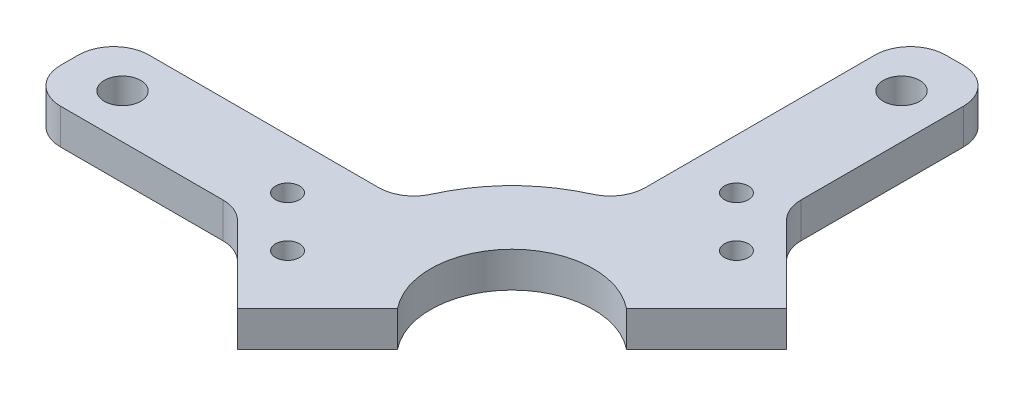
ISO-10303-21;
HEADER;
FILE_DESCRIPTION(('STEP AP214'),'2;1');
FILE_NAME('part.step','',(''),(''),'','','');
FILE_SCHEMA(('AUTOMOTIVE_DESIGN { 1 0 10303 214 1 1 1 1 }'));
ENDSEC;
DATA;
#1=APPLICATION_CONTEXT('core data for automotive mechanical design processes');
#2=APPLICATION_PROTOCOL_DEFINITION('international standard','automotive_design',2000,#1);
#3=PRODUCT_CONTEXT('',#1,'mechanical');
#4=PRODUCT('Part','Part','',(#3));
#5=PRODUCT_RELATED_PRODUCT_CATEGORY('part','',(#4));
#6=PRODUCT_DEFINITION_FORMATION('','',#4);
#7=PRODUCT_DEFINITION_CONTEXT('part definition',#1,'design');
#8=PRODUCT_DEFINITION('design','',#6,#7);
#9=PRODUCT_DEFINITION_SHAPE('','',#8);
#10=(LENGTH_UNIT() NAMED_UNIT(*) SI_UNIT(.MILLI.,.METRE.));
#11=(NAMED_UNIT(*) PLANE_ANGLE_UNIT() SI_UNIT($,.RADIAN.));
#12=(NAMED_UNIT(*) SI_UNIT($,.STERADIAN.) SOLID_ANGLE_UNIT());
#13=UNCERTAINTY_MEASURE_WITH_UNIT(LENGTH_MEASURE(1.E-05),#10,'distance_accuracy_value','');
#14=(GEOMETRIC_REPRESENTATION_CONTEXT(3) GLOBAL_UNCERTAINTY_ASSIGNED_CONTEXT((#13)) GLOBAL_UNIT_ASSIGNED_CONTEXT((#10,
#11,#12)) REPRESENTATION_CONTEXT('',''));
#15=CARTESIAN_POINT('',(0.,0.,0.));
#16=DIRECTION('',(0.,0.,1.));
#17=DIRECTION('',(1.,0.,0.));
#18=AXIS2_PLACEMENT_3D('',#15,#16,#17);
#19=CARTESIAN_POINT('',(7.93750000000073,0.,-73.0249999999999));
#20=DIRECTION('',(1.,0.,0.));
#21=DIRECTION('',(0.,0.,-1.));
#22=AXIS2_PLACEMENT_3D('',#19,#20,#21);
#23=PLANE('',#22);
#24=DIRECTION('',(0.,0.,-1.));
#25=VECTOR('',#24,1.);
#26=CARTESIAN_POINT('',(7.93750000000073,6.35,-73.0249999999999));
#27=LINE('',#26,#25);
#28=CARTESIAN_POINT('',(7.93750000000044,6.35,-43.9246129988201));
#29=VERTEX_POINT('',#28);
#30=CARTESIAN_POINT('',(7.93750000000073,6.35,-73.0249999999999));
#31=VERTEX_POINT('',#30);
#32=EDGE_CURVE('E235',#29,#31,#27,.T.);
#33=ORIENTED_EDGE('',*,*,#32,.F.);
#34=DIRECTION('',(0.,-1.,0.));
#35=VECTOR('',#34,1.);
#36=CARTESIAN_POINT('',(7.93750000000044,0.,-43.9246129988201));
#37=LINE('',#36,#35);
#38=CARTESIAN_POINT('',(7.93750000000044,0.,-43.9246129988201));
#39=VERTEX_POINT('',#38);
#40=EDGE_CURVE('E402',#29,#39,#37,.T.);
#41=ORIENTED_EDGE('',*,*,#40,.T.);
#42=DIRECTION('',(0.,0.,-1.));
#43=VECTOR('',#42,1.);
#44=CARTESIAN_POINT('',(7.93750000000073,0.,-73.0249999999999));
#45=LINE('',#44,#43);
#46=CARTESIAN_POINT('',(7.93750000000073,0.,-73.0249999999999));
#47=VERTEX_POINT('',#46);
#48=EDGE_CURVE('E303',#39,#47,#45,.T.);
#49=ORIENTED_EDGE('',*,*,#48,.T.);
#50=DIRECTION('',(0.,1.,0.));
#51=VECTOR('',#50,1.);
#52=CARTESIAN_POINT('',(7.93750000000073,0.,-73.0249999999999));
#53=LINE('',#52,#51);
#54=EDGE_CURVE('E298',#47,#31,#53,.T.);
#55=ORIENTED_EDGE('',*,*,#54,.T.);
#56=EDGE_LOOP('',(#33,#41,#49,#55));
#57=FACE_BOUND('',#56,.T.);
#58=ADVANCED_FACE('F39',(#57),#23,.T.);
#59=CARTESIAN_POINT('',(0.,6.35,0.));
#60=DIRECTION('',(0.,1.,0.));
#61=DIRECTION('',(0.,0.,1.));
#62=AXIS2_PLACEMENT_3D('',#59,#60,#61);
#63=PLANE('',#62);
#64=CARTESIAN_POINT('',(10.0230122421383,6.35,-30.2285885145439));
#65=DIRECTION('',(0.,1.,0.));
#66=DIRECTION('',(0.,0.,1.));
#67=AXIS2_PLACEMENT_3D('',#64,#65,#66);
#68=CIRCLE('',#67,2.15265);
#69=CARTESIAN_POINT('',(10.0230122421383,6.35,-28.0759385145439));
#70=VERTEX_POINT('',#69);
#71=EDGE_CURVE('E508',#70,#70,#68,.T.);
#72=ORIENTED_EDGE('',*,*,#71,.F.);
#73=EDGE_LOOP('',(#72));
#74=FACE_BOUND('',#73,.T.);
#75=CARTESIAN_POINT('',(1.04275612106917,6.35,-39.208844635613));
#76=DIRECTION('',(0.,1.,0.));
#77=DIRECTION('',(0.,0.,1.));
#78=AXIS2_PLACEMENT_3D('',#75,#76,#77);
#79=CIRCLE('',#78,2.15265);
#80=CARTESIAN_POINT('',(1.04275612106917,6.35,-37.056194635613));
#81=VERTEX_POINT('',#80);
#82=EDGE_CURVE('E496',#81,#81,#79,.T.);
#83=ORIENTED_EDGE('',*,*,#82,.F.);
#84=EDGE_LOOP('',(#83));
#85=FACE_BOUND('',#84,.T.);
#86=DIRECTION('',(0.,0.,1.));
#87=VECTOR('',#86,1.);
#88=CARTESIAN_POINT('',(-7.93749999999926,6.35,-73.0250000000001));
#89=LINE('',#88,#87);
#90=CARTESIAN_POINT('',(-7.93749999999926,6.35,-73.0250000000001));
#91=VERTEX_POINT('',#90);
#92=CARTESIAN_POINT('',(-7.93749999999969,6.35,-31.8688400910671));
#93=VERTEX_POINT('',#92);
#94=EDGE_CURVE('E316',#91,#93,#89,.T.);
#95=ORIENTED_EDGE('',*,*,#94,.T.);
#96=CARTESIAN_POINT('',(-14.2874999999997,6.35,-31.8688400910672));
#97=DIRECTION('',(0.,1.,0.));
#98=DIRECTION('',(0.,0.,1.));
#99=AXIS2_PLACEMENT_3D('',#96,#97,#98);
#100=CIRCLE('',#99,6.35);
#101=CARTESIAN_POINT('',(-11.6897727272725,6.35,-26.0745055290549));
#102=VERTEX_POINT('',#101);
#103=EDGE_CURVE('E393',#93,#102,#100,.F.);
#104=ORIENTED_EDGE('',*,*,#103,.T.);
#105=CARTESIAN_POINT('',(0.,6.35,0.));
#106=DIRECTION('',(0.,1.,0.));
#107=DIRECTION('',(0.,0.,1.));
#108=AXIS2_PLACEMENT_3D('',#105,#106,#107);
#109=CIRCLE('',#108,28.575);
#110=CARTESIAN_POINT('',(-26.0745055290548,6.35,-11.6897727272727));
#111=VERTEX_POINT('',#110);
#112=EDGE_CURVE('E282',#102,#111,#109,.T.);
#113=ORIENTED_EDGE('',*,*,#112,.T.);
#114=CARTESIAN_POINT('',(-31.868840091067,6.35,-14.2875));
#115=DIRECTION('',(0.,1.,0.));
#116=DIRECTION('',(0.,0.,1.));
#117=AXIS2_PLACEMENT_3D('',#114,#115,#116);
#118=CIRCLE('',#117,6.35);
#119=CARTESIAN_POINT('',(-31.868840091067,6.35,-7.93749999999998));
#120=VERTEX_POINT('',#119);
#121=EDGE_CURVE('E396',#111,#120,#118,.F.);
#122=ORIENTED_EDGE('',*,*,#121,.T.);
#123=DIRECTION('',(-1.,0.,0.));
#124=VECTOR('',#123,1.);
#125=CARTESIAN_POINT('',(-73.025,6.35,-7.93749999999997));
#126=LINE('',#125,#124);
#127=CARTESIAN_POINT('',(-73.025,6.35,-7.93749999999997));
#128=VERTEX_POINT('',#127);
#129=EDGE_CURVE('E279',#120,#128,#126,.T.);
#130=ORIENTED_EDGE('',*,*,#129,.T.);
#131=CARTESIAN_POINT('',(-73.025,6.35,-1.58749999999997));
#132=DIRECTION('',(0.,1.,0.));
#133=DIRECTION('',(0.,0.,1.));
#134=AXIS2_PLACEMENT_3D('',#131,#132,#133);
#135=CIRCLE('',#134,6.35);
#136=CARTESIAN_POINT('',(-79.375,6.35,-1.58749999999997));
#137=VERTEX_POINT('',#136);
#138=EDGE_CURVE('E275',#128,#137,#135,.T.);
#139=ORIENTED_EDGE('',*,*,#138,.T.);
#140=DIRECTION('',(0.,0.,1.));
#141=VECTOR('',#140,1.);
#142=CARTESIAN_POINT('',(-79.375,6.35,-1.58749999999997));
#143=LINE('',#142,#141);
#144=CARTESIAN_POINT('',(-79.375,6.35,1.58750000000003));
#145=VERTEX_POINT('',#144);
#146=EDGE_CURVE('E271',#137,#145,#143,.T.);
#147=ORIENTED_EDGE('',*,*,#146,.T.);
#148=CARTESIAN_POINT('',(-73.025,6.35,1.58750000000003));
#149=DIRECTION('',(0.,1.,0.));
#150=DIRECTION('',(0.,0.,-1.));
#151=AXIS2_PLACEMENT_3D('',#148,#149,#150);
#152=CIRCLE('',#151,6.35);
#153=CARTESIAN_POINT('',(-73.025,6.35,7.93750000000003));
#154=VERTEX_POINT('',#153);
#155=EDGE_CURVE('E267',#145,#154,#152,.T.);
#156=ORIENTED_EDGE('',*,*,#155,.T.);
#157=DIRECTION('',(1.,0.,0.));
#158=VECTOR('',#157,1.);
#159=CARTESIAN_POINT('',(-73.025,6.35,7.93750000000003));
#160=LINE('',#159,#158);
#161=CARTESIAN_POINT('',(-43.9246129988205,6.35,7.93750000000003));
#162=VERTEX_POINT('',#161);
#163=EDGE_CURVE('E263',#154,#162,#160,.T.);
#164=ORIENTED_EDGE('',*,*,#163,.T.);
#165=CARTESIAN_POINT('',(-43.9246129988205,6.35,14.2875));
#166=DIRECTION('',(0.,1.,0.));
#167=DIRECTION('',(0.,0.,1.));
#168=AXIS2_PLACEMENT_3D('',#165,#166,#167);
#169=CIRCLE('',#168,6.35);
#170=CARTESIAN_POINT('',(-39.4344849382859,6.35,9.79737193946545));
#171=VERTEX_POINT('',#170);
#172=EDGE_CURVE('E11',#162,#171,#169,.F.);
#173=ORIENTED_EDGE('',*,*,#172,.T.);
#174=DIRECTION('',(0.707106781186548,0.,0.707106781186547));
#175=VECTOR('',#174,1.);
#176=CARTESIAN_POINT('',(-25.7384604540093,6.35,23.4933964237421));
#177=LINE('',#176,#175);
#178=CARTESIAN_POINT('',(-25.7384604540093,6.35,23.4933964237421));
#179=VERTEX_POINT('',#178);
#180=EDGE_CURVE('E225',#171,#179,#177,.T.);
#181=ORIENTED_EDGE('',*,*,#180,.T.);
#182=DIRECTION('',(-0.707106781186546,0.,0.707106781186549));
#183=VECTOR('',#182,1.);
#184=CARTESIAN_POINT('',(-38.2941829917116,6.35,36.0491189614445));
#185=LINE('',#184,#183);
#186=CARTESIAN_POINT('',(-11.3886381111663,6.35,9.14357408089908));
#187=VERTEX_POINT('',#186);
#188=EDGE_CURVE('E243',#187,#179,#185,.T.);
#189=ORIENTED_EDGE('',*,*,#188,.F.);
#190=CARTESIAN_POINT('',(0.,6.35,0.));
#191=DIRECTION('',(0.,1.,0.));
#192=DIRECTION('',(0.,0.,1.));
#193=AXIS2_PLACEMENT_3D('',#190,#191,#192);
#194=CIRCLE('',#193,14.605);
#195=CARTESIAN_POINT('',(9.14357408089904,6.35,-11.3886381111664));
#196=VERTEX_POINT('',#195);
#197=EDGE_CURVE('E363',#196,#187,#194,.T.);
#198=ORIENTED_EDGE('',*,*,#197,.F.);
#199=CARTESIAN_POINT('',(23.4933964237421,6.35,-25.7384604540093));
#200=VERTEX_POINT('',#199);
#201=EDGE_CURVE('E239',#200,#196,#185,.T.);
#202=ORIENTED_EDGE('',*,*,#201,.F.);
#203=DIRECTION('',(0.707106781186547,0.,0.707106781186547));
#204=VECTOR('',#203,1.);
#205=CARTESIAN_POINT('',(23.4933964237421,6.35,-25.7384604540093));
#206=LINE('',#205,#204);
#207=CARTESIAN_POINT('',(9.79737193946587,6.35,-39.4344849382855));
#208=VERTEX_POINT('',#207);
#209=EDGE_CURVE('E189',#208,#200,#206,.T.);
#210=ORIENTED_EDGE('',*,*,#209,.F.);
#211=CARTESIAN_POINT('',(14.2875000000004,6.35,-43.9246129988201));
#212=DIRECTION('',(0.,1.,0.));
#213=DIRECTION('',(0.,0.,1.));
#214=AXIS2_PLACEMENT_3D('',#211,#212,#213);
#215=CIRCLE('',#214,6.35);
#216=EDGE_CURVE('E417',#208,#29,#215,.F.);
#217=ORIENTED_EDGE('',*,*,#216,.T.);
#218=ORIENTED_EDGE('',*,*,#32,.T.);
#219=CARTESIAN_POINT('',(1.58750000000073,6.35,-73.025));
#220=DIRECTION('',(0.,1.,0.));
#221=DIRECTION('',(-1.,0.,0.));
#222=AXIS2_PLACEMENT_3D('',#219,#220,#221);
#223=CIRCLE('',#222,6.35);
#224=CARTESIAN_POINT('',(1.5875000000008,6.35,-79.375));
#225=VERTEX_POINT('',#224);
#226=EDGE_CURVE('E327',#31,#225,#223,.T.);
#227=ORIENTED_EDGE('',*,*,#226,.T.);
#228=DIRECTION('',(-1.,0.,0.));
#229=VECTOR('',#228,1.);
#230=CARTESIAN_POINT('',(1.5875000000008,6.35,-79.375));
#231=LINE('',#230,#229);
#232=CARTESIAN_POINT('',(-1.5874999999992,6.35,-79.375));
#233=VERTEX_POINT('',#232);
#234=EDGE_CURVE('E323',#225,#233,#231,.T.);
#235=ORIENTED_EDGE('',*,*,#234,.T.);
#236=CARTESIAN_POINT('',(-1.58749999999927,6.35,-73.025));
#237=DIRECTION('',(0.,1.,0.));
#238=DIRECTION('',(1.,0.,0.));
#239=AXIS2_PLACEMENT_3D('',#236,#237,#238);
#240=CIRCLE('',#239,6.35);
#241=EDGE_CURVE('E319',#233,#91,#240,.T.);
#242=ORIENTED_EDGE('',*,*,#241,.T.);
#243=EDGE_LOOP('',(#95,#104,#113,#122,#130,#139,#147,#156,#164,#173,#181,#189,#198,#202,#210,
#217,#218,#227,#235,#242));
#244=FACE_BOUND('',#243,.T.);
#245=CARTESIAN_POINT('',(7.31639914554578E-13,6.35,-69.85));
#246=DIRECTION('',(0.,1.,0.));
#247=DIRECTION('',(0.,0.,1.));
#248=AXIS2_PLACEMENT_3D('',#245,#246,#247);
#249=CIRCLE('',#248,3.2639);
#250=CARTESIAN_POINT('',(7.31639914554578E-13,6.35,-66.5861));
#251=VERTEX_POINT('',#250);
#252=EDGE_CURVE('E244',#251,#251,#249,.T.);
#253=ORIENTED_EDGE('',*,*,#252,.F.);
#254=EDGE_LOOP('',(#253));
#255=FACE_BOUND('',#254,.T.);
#256=CARTESIAN_POINT('',(-30.2285885145439,6.35,10.0230122421383));
#257=DIRECTION('',(0.,1.,0.));
#258=DIRECTION('',(0.,0.,1.));
#259=AXIS2_PLACEMENT_3D('',#256,#257,#258);
#260=CIRCLE('',#259,2.15265);
#261=CARTESIAN_POINT('',(-30.2285885145439,6.35,12.1756622421383));
#262=VERTEX_POINT('',#261);
#263=EDGE_CURVE('E206',#262,#262,#260,.T.);
#264=ORIENTED_EDGE('',*,*,#263,.F.);
#265=EDGE_LOOP('',(#264));
#266=FACE_BOUND('',#265,.T.);
#267=CARTESIAN_POINT('',(-39.208844635613,6.35,1.04275612106918));
#268=DIRECTION('',(0.,1.,0.));
#269=DIRECTION('',(0.,0.,1.));
#270=AXIS2_PLACEMENT_3D('',#267,#268,#269);
#271=CIRCLE('',#270,2.15265);
#272=CARTESIAN_POINT('',(-39.208844635613,6.35,3.19540612106918));
#273=VERTEX_POINT('',#272);
#274=EDGE_CURVE('E217',#273,#273,#271,.T.);
#275=ORIENTED_EDGE('',*,*,#274,.F.);
#276=EDGE_LOOP('',(#275));
#277=FACE_BOUND('',#276,.T.);
#278=CARTESIAN_POINT('',(-69.85,6.35,0.));
#279=DIRECTION('',(0.,1.,0.));
#280=DIRECTION('',(0.,0.,1.));
#281=AXIS2_PLACEMENT_3D('',#278,#279,#280);
#282=CIRCLE('',#281,3.2639);
#283=CARTESIAN_POINT('',(-69.85,6.35,3.2639));
#284=VERTEX_POINT('',#283);
#285=EDGE_CURVE('E307',#284,#284,#282,.T.);
#286=ORIENTED_EDGE('',*,*,#285,.F.);
#287=EDGE_LOOP('',(#286));
#288=FACE_BOUND('',#287,.T.);
#289=ADVANCED_FACE('F427',(#74,#85,#244,#255,#266,#277,#288),#63,.T.);
#290=CARTESIAN_POINT('',(0.,0.,0.));
#291=DIRECTION('',(0.,1.,0.));
#292=DIRECTION('',(0.,0.,1.));
#293=AXIS2_PLACEMENT_3D('',#290,#291,#292);
#294=PLANE('',#293);
#295=CARTESIAN_POINT('',(10.0230122421383,0.,-30.2285885145439));
#296=DIRECTION('',(0.,1.,0.));
#297=DIRECTION('',(0.,0.,1.));
#298=AXIS2_PLACEMENT_3D('',#295,#296,#297);
#299=CIRCLE('',#298,2.15265);
#300=CARTESIAN_POINT('',(10.0230122421383,0.,-28.0759385145439));
#301=VERTEX_POINT('',#300);
#302=EDGE_CURVE('E502',#301,#301,#299,.T.);
#303=ORIENTED_EDGE('',*,*,#302,.T.);
#304=EDGE_LOOP('',(#303));
#305=FACE_BOUND('',#304,.T.);
#306=CARTESIAN_POINT('',(1.04275612106917,0.,-39.208844635613));
#307=DIRECTION('',(0.,1.,0.));
#308=DIRECTION('',(0.,0.,1.));
#309=AXIS2_PLACEMENT_3D('',#306,#307,#308);
#310=CIRCLE('',#309,2.15265);
#311=CARTESIAN_POINT('',(1.04275612106917,0.,-37.056194635613));
#312=VERTEX_POINT('',#311);
#313=EDGE_CURVE('E493',#312,#312,#310,.T.);
#314=ORIENTED_EDGE('',*,*,#313,.T.);
#315=EDGE_LOOP('',(#314));
#316=FACE_BOUND('',#315,.T.);
#317=DIRECTION('',(-0.707106781186546,0.,0.707106781186549));
#318=VECTOR('',#317,1.);
#319=CARTESIAN_POINT('',(-38.2941829917116,0.,36.0491189614445));
#320=LINE('',#319,#318);
#321=CARTESIAN_POINT('',(23.4933964237421,0.,-25.7384604540093));
#322=VERTEX_POINT('',#321);
#323=CARTESIAN_POINT('',(9.14357408089904,0.,-11.3886381111664));
#324=VERTEX_POINT('',#323);
#325=EDGE_CURVE('E180',#322,#324,#320,.T.);
#326=ORIENTED_EDGE('',*,*,#325,.T.);
#327=CARTESIAN_POINT('',(0.,0.,0.));
#328=DIRECTION('',(0.,1.,0.));
#329=DIRECTION('',(0.,0.,1.));
#330=AXIS2_PLACEMENT_3D('',#327,#328,#329);
#331=CIRCLE('',#330,14.605);
#332=CARTESIAN_POINT('',(-11.3886381111663,0.,9.14357408089908));
#333=VERTEX_POINT('',#332);
#334=EDGE_CURVE('E198',#324,#333,#331,.T.);
#335=ORIENTED_EDGE('',*,*,#334,.T.);
#336=CARTESIAN_POINT('',(-25.7384604540093,0.,23.4933964237421));
#337=VERTEX_POINT('',#336);
#338=EDGE_CURVE('E201',#333,#337,#320,.T.);
#339=ORIENTED_EDGE('',*,*,#338,.T.);
#340=DIRECTION('',(0.707106781186548,0.,0.707106781186547));
#341=VECTOR('',#340,1.);
#342=CARTESIAN_POINT('',(-25.7384604540093,0.,23.4933964237421));
#343=LINE('',#342,#341);
#344=CARTESIAN_POINT('',(-39.4344849382859,0.,9.79737193946545));
#345=VERTEX_POINT('',#344);
#346=EDGE_CURVE('E226',#345,#337,#343,.T.);
#347=ORIENTED_EDGE('',*,*,#346,.F.);
#348=CARTESIAN_POINT('',(-43.9246129988205,0.,14.2875));
#349=DIRECTION('',(0.,1.,0.));
#350=DIRECTION('',(0.,0.,1.));
#351=AXIS2_PLACEMENT_3D('',#348,#349,#350);
#352=CIRCLE('',#351,6.35);
#353=CARTESIAN_POINT('',(-43.9246129988205,0.,7.93750000000003));
#354=VERTEX_POINT('',#353);
#355=EDGE_CURVE('E48',#345,#354,#352,.T.);
#356=ORIENTED_EDGE('',*,*,#355,.T.);
#357=DIRECTION('',(1.,0.,0.));
#358=VECTOR('',#357,1.);
#359=CARTESIAN_POINT('',(-73.025,0.,7.93750000000003));
#360=LINE('',#359,#358);
#361=CARTESIAN_POINT('',(-73.025,0.,7.93750000000003));
#362=VERTEX_POINT('',#361);
#363=EDGE_CURVE('E283',#362,#354,#360,.T.);
#364=ORIENTED_EDGE('',*,*,#363,.F.);
#365=CARTESIAN_POINT('',(-73.025,0.,1.58750000000003));
#366=DIRECTION('',(0.,1.,0.));
#367=DIRECTION('',(0.,0.,-1.));
#368=AXIS2_PLACEMENT_3D('',#365,#366,#367);
#369=CIRCLE('',#368,6.35);
#370=CARTESIAN_POINT('',(-79.375,0.,1.58750000000003));
#371=VERTEX_POINT('',#370);
#372=EDGE_CURVE('E249',#371,#362,#369,.T.);
#373=ORIENTED_EDGE('',*,*,#372,.F.);
#374=DIRECTION('',(0.,0.,1.));
#375=VECTOR('',#374,1.);
#376=CARTESIAN_POINT('',(-79.375,0.,-1.58749999999997));
#377=LINE('',#376,#375);
#378=CARTESIAN_POINT('',(-79.375,0.,-1.58749999999997));
#379=VERTEX_POINT('',#378);
#380=EDGE_CURVE('E259',#379,#371,#377,.T.);
#381=ORIENTED_EDGE('',*,*,#380,.F.);
#382=CARTESIAN_POINT('',(-73.025,0.,-1.58749999999997));
#383=DIRECTION('',(0.,1.,0.));
#384=DIRECTION('',(0.,0.,1.));
#385=AXIS2_PLACEMENT_3D('',#382,#383,#384);
#386=CIRCLE('',#385,6.35);
#387=CARTESIAN_POINT('',(-73.025,0.,-7.93749999999997));
#388=VERTEX_POINT('',#387);
#389=EDGE_CURVE('E255',#388,#379,#386,.T.);
#390=ORIENTED_EDGE('',*,*,#389,.F.);
#391=DIRECTION('',(-1.,0.,0.));
#392=VECTOR('',#391,1.);
#393=CARTESIAN_POINT('',(-73.025,0.,-7.93749999999997));
#394=LINE('',#393,#392);
#395=CARTESIAN_POINT('',(-31.868840091067,0.,-7.93749999999998));
#396=VERTEX_POINT('',#395);
#397=EDGE_CURVE('E250',#396,#388,#394,.T.);
#398=ORIENTED_EDGE('',*,*,#397,.F.);
#399=CARTESIAN_POINT('',(-31.868840091067,0.,-14.2875));
#400=DIRECTION('',(0.,1.,0.));
#401=DIRECTION('',(0.,0.,1.));
#402=AXIS2_PLACEMENT_3D('',#399,#400,#401);
#403=CIRCLE('',#402,6.35);
#404=CARTESIAN_POINT('',(-26.0745055290548,0.,-11.6897727272727));
#405=VERTEX_POINT('',#404);
#406=EDGE_CURVE('E399',#396,#405,#403,.T.);
#407=ORIENTED_EDGE('',*,*,#406,.T.);
#408=CARTESIAN_POINT('',(0.,0.,0.));
#409=DIRECTION('',(0.,1.,0.));
#410=DIRECTION('',(0.,0.,1.));
#411=AXIS2_PLACEMENT_3D('',#408,#409,#410);
#412=CIRCLE('',#411,28.575);
#413=CARTESIAN_POINT('',(-11.6897727272725,0.,-26.0745055290549));
#414=VERTEX_POINT('',#413);
#415=EDGE_CURVE('E286',#414,#405,#412,.T.);
#416=ORIENTED_EDGE('',*,*,#415,.F.);
#417=CARTESIAN_POINT('',(-14.2874999999997,0.,-31.8688400910672));
#418=DIRECTION('',(0.,1.,0.));
#419=DIRECTION('',(0.,0.,1.));
#420=AXIS2_PLACEMENT_3D('',#417,#418,#419);
#421=CIRCLE('',#420,6.35);
#422=CARTESIAN_POINT('',(-7.93749999999969,0.,-31.8688400910671));
#423=VERTEX_POINT('',#422);
#424=EDGE_CURVE('E389',#414,#423,#421,.T.);
#425=ORIENTED_EDGE('',*,*,#424,.T.);
#426=DIRECTION('',(0.,0.,1.));
#427=VECTOR('',#426,1.);
#428=CARTESIAN_POINT('',(-7.93749999999926,0.,-73.0250000000001));
#429=LINE('',#428,#427);
#430=CARTESIAN_POINT('',(-7.93749999999926,0.,-73.0250000000001));
#431=VERTEX_POINT('',#430);
#432=EDGE_CURVE('E254',#431,#423,#429,.T.);
#433=ORIENTED_EDGE('',*,*,#432,.F.);
#434=CARTESIAN_POINT('',(-1.58749999999927,0.,-73.025));
#435=DIRECTION('',(0.,1.,0.));
#436=DIRECTION('',(1.,0.,0.));
#437=AXIS2_PLACEMENT_3D('',#434,#435,#436);
#438=CIRCLE('',#437,6.35);
#439=CARTESIAN_POINT('',(-1.5874999999992,0.,-79.375));
#440=VERTEX_POINT('',#439);
#441=EDGE_CURVE('E302',#440,#431,#438,.T.);
#442=ORIENTED_EDGE('',*,*,#441,.F.);
#443=DIRECTION('',(-1.,0.,0.));
#444=VECTOR('',#443,1.);
#445=CARTESIAN_POINT('',(1.5875000000008,0.,-79.375));
#446=LINE('',#445,#444);
#447=CARTESIAN_POINT('',(1.5875000000008,0.,-79.375));
#448=VERTEX_POINT('',#447);
#449=EDGE_CURVE('E312',#448,#440,#446,.T.);
#450=ORIENTED_EDGE('',*,*,#449,.F.);
#451=CARTESIAN_POINT('',(1.58750000000073,0.,-73.025));
#452=DIRECTION('',(0.,1.,0.));
#453=DIRECTION('',(-1.,0.,0.));
#454=AXIS2_PLACEMENT_3D('',#451,#452,#453);
#455=CIRCLE('',#454,6.35);
#456=EDGE_CURVE('E308',#47,#448,#455,.T.);
#457=ORIENTED_EDGE('',*,*,#456,.F.);
#458=ORIENTED_EDGE('',*,*,#48,.F.);
#459=CARTESIAN_POINT('',(14.2875000000004,0.,-43.9246129988201));
#460=DIRECTION('',(0.,1.,0.));
#461=DIRECTION('',(0.,0.,1.));
#462=AXIS2_PLACEMENT_3D('',#459,#460,#461);
#463=CIRCLE('',#462,6.35);
#464=CARTESIAN_POINT('',(9.79737193946587,0.,-39.4344849382855));
#465=VERTEX_POINT('',#464);
#466=EDGE_CURVE('E183',#39,#465,#463,.T.);
#467=ORIENTED_EDGE('',*,*,#466,.T.);
#468=DIRECTION('',(0.707106781186547,0.,0.707106781186547));
#469=VECTOR('',#468,1.);
#470=CARTESIAN_POINT('',(23.4933964237421,0.,-25.7384604540093));
#471=LINE('',#470,#469);
#472=EDGE_CURVE('E175',#465,#322,#471,.T.);
#473=ORIENTED_EDGE('',*,*,#472,.T.);
#474=EDGE_LOOP('',(#326,#335,#339,#347,#356,#364,#373,#381,#390,#398,#407,#416,#425,#433,#442,
#450,#457,#458,#467,#473));
#475=FACE_BOUND('',#474,.T.);
#476=CARTESIAN_POINT('',(7.31639914554578E-13,0.,-69.85));
#477=DIRECTION('',(0.,1.,0.));
#478=DIRECTION('',(0.,0.,1.));
#479=AXIS2_PLACEMENT_3D('',#476,#477,#478);
#480=CIRCLE('',#479,3.2639);
#481=CARTESIAN_POINT('',(7.31639914554578E-13,0.,-66.5861));
#482=VERTEX_POINT('',#481);
#483=EDGE_CURVE('E199',#482,#482,#480,.T.);
#484=ORIENTED_EDGE('',*,*,#483,.T.);
#485=EDGE_LOOP('',(#484));
#486=FACE_BOUND('',#485,.T.);
#487=CARTESIAN_POINT('',(-69.85,0.,0.));
#488=DIRECTION('',(0.,1.,0.));
#489=DIRECTION('',(0.,0.,1.));
#490=AXIS2_PLACEMENT_3D('',#487,#488,#489);
#491=CIRCLE('',#490,3.2639);
#492=CARTESIAN_POINT('',(-69.85,0.,3.2639));
#493=VERTEX_POINT('',#492);
#494=EDGE_CURVE('E266',#493,#493,#491,.T.);
#495=ORIENTED_EDGE('',*,*,#494,.T.);
#496=EDGE_LOOP('',(#495));
#497=FACE_BOUND('',#496,.T.);
#498=CARTESIAN_POINT('',(-39.208844635613,0.,1.04275612106918));
#499=DIRECTION('',(0.,1.,0.));
#500=DIRECTION('',(0.,0.,1.));
#501=AXIS2_PLACEMENT_3D('',#498,#499,#500);
#502=CIRCLE('',#501,2.15265);
#503=CARTESIAN_POINT('',(-39.208844635613,0.,3.19540612106918));
#504=VERTEX_POINT('',#503);
#505=EDGE_CURVE('E221',#504,#504,#502,.T.);
#506=ORIENTED_EDGE('',*,*,#505,.T.);
#507=EDGE_LOOP('',(#506));
#508=FACE_BOUND('',#507,.T.);
#509=CARTESIAN_POINT('',(-30.2285885145439,0.,10.0230122421383));
#510=DIRECTION('',(0.,1.,0.));
#511=DIRECTION('',(0.,0.,1.));
#512=AXIS2_PLACEMENT_3D('',#509,#510,#511);
#513=CIRCLE('',#512,2.15265);
#514=CARTESIAN_POINT('',(-30.2285885145439,0.,12.1756622421383));
#515=VERTEX_POINT('',#514);
#516=EDGE_CURVE('E210',#515,#515,#513,.T.);
#517=ORIENTED_EDGE('',*,*,#516,.T.);
#518=EDGE_LOOP('',(#517));
#519=FACE_BOUND('',#518,.T.);
#520=ADVANCED_FACE('F177',(#305,#316,#475,#486,#497,#508,#519),#294,.F.);
#521=CARTESIAN_POINT('',(0.,6.35,0.));
#522=DIRECTION('',(0.,-1.,0.));
#523=DIRECTION('',(0.,0.,-1.));
#524=AXIS2_PLACEMENT_3D('',#521,#522,#523);
#525=CYLINDRICAL_SURFACE('',#524,14.605);
#526=DIRECTION('',(0.,-1.,0.));
#527=VECTOR('',#526,1.);
#528=CARTESIAN_POINT('',(9.14357408089904,6.35,-11.3886381111664));
#529=LINE('',#528,#527);
#530=EDGE_CURVE('E195',#196,#324,#529,.T.);
#531=ORIENTED_EDGE('',*,*,#530,.F.);
#532=ORIENTED_EDGE('',*,*,#197,.T.);
#533=DIRECTION('',(0.,-1.,0.));
#534=VECTOR('',#533,1.);
#535=CARTESIAN_POINT('',(-11.3886381111663,6.35,9.14357408089908));
#536=LINE('',#535,#534);
#537=EDGE_CURVE('E240',#333,#187,#536,.F.);
#538=ORIENTED_EDGE('',*,*,#537,.F.);
#539=ORIENTED_EDGE('',*,*,#334,.F.);
#540=EDGE_LOOP('',(#531,#532,#538,#539));
#541=FACE_BOUND('',#540,.T.);
#542=ADVANCED_FACE('F424',(#541),#525,.F.);
#543=CARTESIAN_POINT('',(0.,6.35,0.));
#544=DIRECTION('',(0.,-1.,0.));
#545=DIRECTION('',(0.,0.,-1.));
#546=AXIS2_PLACEMENT_3D('',#543,#544,#545);
#547=CYLINDRICAL_SURFACE('',#546,28.575);
#548=ORIENTED_EDGE('',*,*,#112,.F.);
#549=DIRECTION('',(0.,-1.,0.));
#550=VECTOR('',#549,1.);
#551=CARTESIAN_POINT('',(-11.6897727272725,6.35,-26.0745055290549));
#552=LINE('',#551,#550);
#553=EDGE_CURVE('E378',#102,#414,#552,.T.);
#554=ORIENTED_EDGE('',*,*,#553,.T.);
#555=ORIENTED_EDGE('',*,*,#415,.T.);
#556=DIRECTION('',(0.,-1.,0.));
#557=VECTOR('',#556,1.);
#558=CARTESIAN_POINT('',(-26.0745055290548,6.35,-11.6897727272727));
#559=LINE('',#558,#557);
#560=EDGE_CURVE('E238',#405,#111,#559,.F.);
#561=ORIENTED_EDGE('',*,*,#560,.T.);
#562=EDGE_LOOP('',(#548,#554,#555,#561));
#563=FACE_BOUND('',#562,.T.);
#564=ADVANCED_FACE('F462',(#563),#547,.T.);
#565=CARTESIAN_POINT('',(-73.025,0.,7.93750000000003));
#566=DIRECTION('',(0.,0.,1.));
#567=DIRECTION('',(1.,0.,0.));
#568=AXIS2_PLACEMENT_3D('',#565,#566,#567);
#569=PLANE('',#568);
#570=ORIENTED_EDGE('',*,*,#363,.T.);
#571=DIRECTION('',(0.,-1.,0.));
#572=VECTOR('',#571,1.);
#573=CARTESIAN_POINT('',(-43.9246129988205,6.35,7.93750000000002));
#574=LINE('',#573,#572);
#575=EDGE_CURVE('E61',#354,#162,#574,.F.);
#576=ORIENTED_EDGE('',*,*,#575,.T.);
#577=ORIENTED_EDGE('',*,*,#163,.F.);
#578=DIRECTION('',(0.,1.,0.));
#579=VECTOR('',#578,1.);
#580=CARTESIAN_POINT('',(-73.025,0.,7.93750000000003));
#581=LINE('',#580,#579);
#582=EDGE_CURVE('E260',#362,#154,#581,.T.);
#583=ORIENTED_EDGE('',*,*,#582,.F.);
#584=EDGE_LOOP('',(#570,#576,#577,#583));
#585=FACE_BOUND('',#584,.T.);
#586=ADVANCED_FACE('F439',(#585),#569,.T.);
#587=CARTESIAN_POINT('',(-73.025,0.,-7.93749999999997));
#588=DIRECTION('',(0.,0.,-1.));
#589=DIRECTION('',(-1.,0.,0.));
#590=AXIS2_PLACEMENT_3D('',#587,#588,#589);
#591=PLANE('',#590);
#592=DIRECTION('',(0.,1.,0.));
#593=VECTOR('',#592,1.);
#594=CARTESIAN_POINT('',(-73.025,0.,-7.93749999999997));
#595=LINE('',#594,#593);
#596=EDGE_CURVE('E245',#388,#128,#595,.T.);
#597=ORIENTED_EDGE('',*,*,#596,.T.);
#598=ORIENTED_EDGE('',*,*,#129,.F.);
#599=DIRECTION('',(0.,-1.,0.));
#600=VECTOR('',#599,1.);
#601=CARTESIAN_POINT('',(-31.868840091067,0.,-7.93749999999998));
#602=LINE('',#601,#600);
#603=EDGE_CURVE('E386',#120,#396,#602,.T.);
#604=ORIENTED_EDGE('',*,*,#603,.T.);
#605=ORIENTED_EDGE('',*,*,#397,.T.);
#606=EDGE_LOOP('',(#597,#598,#604,#605));
#607=FACE_BOUND('',#606,.T.);
#608=ADVANCED_FACE('F609',(#607),#591,.T.);
#609=CARTESIAN_POINT('',(-73.025,0.,1.58750000000003));
#610=DIRECTION('',(0.,1.,0.));
#611=DIRECTION('',(0.,0.,1.));
#612=AXIS2_PLACEMENT_3D('',#609,#610,#611);
#613=CYLINDRICAL_SURFACE('',#612,6.35);
#614=ORIENTED_EDGE('',*,*,#155,.F.);
#615=DIRECTION('',(0.,1.,0.));
#616=VECTOR('',#615,1.);
#617=CARTESIAN_POINT('',(-79.375,0.,1.58750000000003));
#618=LINE('',#617,#616);
#619=EDGE_CURVE('E256',#371,#145,#618,.T.);
#620=ORIENTED_EDGE('',*,*,#619,.F.);
#621=ORIENTED_EDGE('',*,*,#372,.T.);
#622=ORIENTED_EDGE('',*,*,#582,.T.);
#623=EDGE_LOOP('',(#614,#620,#621,#622));
#624=FACE_BOUND('',#623,.T.);
#625=ADVANCED_FACE('F442',(#624),#613,.T.);
#626=CARTESIAN_POINT('',(-79.375,0.,-1.58749999999997));
#627=DIRECTION('',(-1.,0.,0.));
#628=DIRECTION('',(0.,0.,1.));
#629=AXIS2_PLACEMENT_3D('',#626,#627,#628);
#630=PLANE('',#629);
#631=ORIENTED_EDGE('',*,*,#146,.F.);
#632=DIRECTION('',(0.,1.,0.));
#633=VECTOR('',#632,1.);
#634=CARTESIAN_POINT('',(-79.375,0.,-1.58749999999997));
#635=LINE('',#634,#633);
#636=EDGE_CURVE('E251',#379,#137,#635,.T.);
#637=ORIENTED_EDGE('',*,*,#636,.F.);
#638=ORIENTED_EDGE('',*,*,#380,.T.);
#639=ORIENTED_EDGE('',*,*,#619,.T.);
#640=EDGE_LOOP('',(#631,#637,#638,#639));
#641=FACE_BOUND('',#640,.T.);
#642=ADVANCED_FACE('F447',(#641),#630,.T.);
#643=CARTESIAN_POINT('',(-73.025,0.,-1.58749999999997));
#644=DIRECTION('',(0.,1.,0.));
#645=DIRECTION('',(0.,0.,1.));
#646=AXIS2_PLACEMENT_3D('',#643,#644,#645);
#647=CYLINDRICAL_SURFACE('',#646,6.35);
#648=ORIENTED_EDGE('',*,*,#138,.F.);
#649=ORIENTED_EDGE('',*,*,#596,.F.);
#650=ORIENTED_EDGE('',*,*,#389,.T.);
#651=ORIENTED_EDGE('',*,*,#636,.T.);
#652=EDGE_LOOP('',(#648,#649,#650,#651));
#653=FACE_BOUND('',#652,.T.);
#654=ADVANCED_FACE('F450',(#653),#647,.T.);
#655=CARTESIAN_POINT('',(-7.93749999999926,0.,-73.0250000000001));
#656=DIRECTION('',(-1.,0.,0.));
#657=DIRECTION('',(0.,0.,1.));
#658=AXIS2_PLACEMENT_3D('',#655,#656,#657);
#659=PLANE('',#658);
#660=DIRECTION('',(0.,-1.,0.));
#661=VECTOR('',#660,1.);
#662=CARTESIAN_POINT('',(-7.93749999999969,0.,-31.8688400910671));
#663=LINE('',#662,#661);
#664=EDGE_CURVE('E382',#423,#93,#663,.F.);
#665=ORIENTED_EDGE('',*,*,#664,.T.);
#666=ORIENTED_EDGE('',*,*,#94,.F.);
#667=DIRECTION('',(0.,1.,0.));
#668=VECTOR('',#667,1.);
#669=CARTESIAN_POINT('',(-7.93749999999926,0.,-73.0250000000001));
#670=LINE('',#669,#668);
#671=EDGE_CURVE('E313',#431,#91,#670,.T.);
#672=ORIENTED_EDGE('',*,*,#671,.F.);
#673=ORIENTED_EDGE('',*,*,#432,.T.);
#674=EDGE_LOOP('',(#665,#666,#672,#673));
#675=FACE_BOUND('',#674,.T.);
#676=ADVANCED_FACE('F474',(#675),#659,.T.);
#677=CARTESIAN_POINT('',(-1.58749999999927,0.,-73.025));
#678=DIRECTION('',(0.,1.,0.));
#679=DIRECTION('',(0.,0.,1.));
#680=AXIS2_PLACEMENT_3D('',#677,#678,#679);
#681=CYLINDRICAL_SURFACE('',#680,6.35);
#682=ORIENTED_EDGE('',*,*,#241,.F.);
#683=DIRECTION('',(0.,1.,0.));
#684=VECTOR('',#683,1.);
#685=CARTESIAN_POINT('',(-1.5874999999992,0.,-79.375));
#686=LINE('',#685,#684);
#687=EDGE_CURVE('E309',#440,#233,#686,.T.);
#688=ORIENTED_EDGE('',*,*,#687,.F.);
#689=ORIENTED_EDGE('',*,*,#441,.T.);
#690=ORIENTED_EDGE('',*,*,#671,.T.);
#691=EDGE_LOOP('',(#682,#688,#689,#690));
#692=FACE_BOUND('',#691,.T.);
#693=ADVANCED_FACE('F477',(#692),#681,.T.);
#694=CARTESIAN_POINT('',(1.5875000000008,0.,-79.375));
#695=DIRECTION('',(0.,0.,-1.));
#696=DIRECTION('',(-1.,0.,0.));
#697=AXIS2_PLACEMENT_3D('',#694,#695,#696);
#698=PLANE('',#697);
#699=ORIENTED_EDGE('',*,*,#234,.F.);
#700=DIRECTION('',(0.,1.,0.));
#701=VECTOR('',#700,1.);
#702=CARTESIAN_POINT('',(1.5875000000008,0.,-79.375));
#703=LINE('',#702,#701);
#704=EDGE_CURVE('E304',#448,#225,#703,.T.);
#705=ORIENTED_EDGE('',*,*,#704,.F.);
#706=ORIENTED_EDGE('',*,*,#449,.T.);
#707=ORIENTED_EDGE('',*,*,#687,.T.);
#708=EDGE_LOOP('',(#699,#705,#706,#707));
#709=FACE_BOUND('',#708,.T.);
#710=ADVANCED_FACE('F480',(#709),#698,.T.);
#711=CARTESIAN_POINT('',(1.58750000000073,0.,-73.025));
#712=DIRECTION('',(0.,1.,0.));
#713=DIRECTION('',(0.,0.,1.));
#714=AXIS2_PLACEMENT_3D('',#711,#712,#713);
#715=CYLINDRICAL_SURFACE('',#714,6.35);
#716=ORIENTED_EDGE('',*,*,#226,.F.);
#717=ORIENTED_EDGE('',*,*,#54,.F.);
#718=ORIENTED_EDGE('',*,*,#456,.T.);
#719=ORIENTED_EDGE('',*,*,#704,.T.);
#720=EDGE_LOOP('',(#716,#717,#718,#719));
#721=FACE_BOUND('',#720,.T.);
#722=ADVANCED_FACE('F485',(#721),#715,.T.);
#723=CARTESIAN_POINT('',(-69.85,6.35,0.));
#724=DIRECTION('',(0.,1.,0.));
#725=DIRECTION('',(0.,0.,1.));
#726=AXIS2_PLACEMENT_3D('',#723,#724,#725);
#727=CYLINDRICAL_SURFACE('',#726,3.2639);
#728=ORIENTED_EDGE('',*,*,#494,.F.);
#729=EDGE_LOOP('',(#728));
#730=FACE_BOUND('',#729,.T.);
#731=ORIENTED_EDGE('',*,*,#285,.T.);
#732=EDGE_LOOP('',(#731));
#733=FACE_BOUND('',#732,.T.);
#734=ADVANCED_FACE('F543',(#730,#733),#727,.F.);
#735=CARTESIAN_POINT('',(7.31639914554578E-13,6.35,-69.85));
#736=DIRECTION('',(0.,1.,0.));
#737=DIRECTION('',(0.,0.,1.));
#738=AXIS2_PLACEMENT_3D('',#735,#736,#737);
#739=CYLINDRICAL_SURFACE('',#738,3.2639);
#740=ORIENTED_EDGE('',*,*,#483,.F.);
#741=EDGE_LOOP('',(#740));
#742=FACE_BOUND('',#741,.T.);
#743=ORIENTED_EDGE('',*,*,#252,.T.);
#744=EDGE_LOOP('',(#743));
#745=FACE_BOUND('',#744,.T.);
#746=ADVANCED_FACE('F552',(#742,#745),#739,.F.);
#747=CARTESIAN_POINT('',(-38.2941829917116,0.,36.0491189614445));
#748=DIRECTION('',(-0.707106781186549,0.,-0.707106781186546));
#749=DIRECTION('',(-0.707106781186546,0.,0.707106781186549));
#750=AXIS2_PLACEMENT_3D('',#747,#748,#749);
#751=PLANE('',#750);
#752=ORIENTED_EDGE('',*,*,#188,.T.);
#753=DIRECTION('',(0.,1.,0.));
#754=VECTOR('',#753,1.);
#755=CARTESIAN_POINT('',(-25.7384604540093,0.,23.4933964237421));
#756=LINE('',#755,#754);
#757=EDGE_CURVE('E229',#337,#179,#756,.T.);
#758=ORIENTED_EDGE('',*,*,#757,.F.);
#759=ORIENTED_EDGE('',*,*,#338,.F.);
#760=ORIENTED_EDGE('',*,*,#537,.T.);
#761=EDGE_LOOP('',(#752,#758,#759,#760));
#762=FACE_BOUND('',#761,.T.);
#763=ADVANCED_FACE('F432',(#762),#751,.F.);
#764=ORIENTED_EDGE('',*,*,#201,.T.);
#765=ORIENTED_EDGE('',*,*,#530,.T.);
#766=ORIENTED_EDGE('',*,*,#325,.F.);
#767=DIRECTION('',(0.,1.,0.));
#768=VECTOR('',#767,1.);
#769=CARTESIAN_POINT('',(23.4933964237421,0.,-25.7384604540093));
#770=LINE('',#769,#768);
#771=EDGE_CURVE('E188',#322,#200,#770,.T.);
#772=ORIENTED_EDGE('',*,*,#771,.T.);
#773=EDGE_LOOP('',(#764,#765,#766,#772));
#774=FACE_BOUND('',#773,.T.);
#775=ADVANCED_FACE('F193',(#774),#751,.F.);
#776=CARTESIAN_POINT('',(-14.2874999999997,6.35,-31.8688400910672));
#777=DIRECTION('',(0.,-1.,0.));
#778=DIRECTION('',(0.,0.,-1.));
#779=AXIS2_PLACEMENT_3D('',#776,#777,#778);
#780=CYLINDRICAL_SURFACE('',#779,6.35);
#781=ORIENTED_EDGE('',*,*,#103,.F.);
#782=ORIENTED_EDGE('',*,*,#664,.F.);
#783=ORIENTED_EDGE('',*,*,#424,.F.);
#784=ORIENTED_EDGE('',*,*,#553,.F.);
#785=EDGE_LOOP('',(#781,#782,#783,#784));
#786=FACE_BOUND('',#785,.T.);
#787=ADVANCED_FACE('F469',(#786),#780,.F.);
#788=CARTESIAN_POINT('',(-31.868840091067,6.35,-14.2875));
#789=DIRECTION('',(0.,-1.,0.));
#790=DIRECTION('',(0.,0.,-1.));
#791=AXIS2_PLACEMENT_3D('',#788,#789,#790);
#792=CYLINDRICAL_SURFACE('',#791,6.35);
#793=ORIENTED_EDGE('',*,*,#406,.F.);
#794=ORIENTED_EDGE('',*,*,#603,.F.);
#795=ORIENTED_EDGE('',*,*,#121,.F.);
#796=ORIENTED_EDGE('',*,*,#560,.F.);
#797=EDGE_LOOP('',(#793,#794,#795,#796));
#798=FACE_BOUND('',#797,.T.);
#799=ADVANCED_FACE('F459',(#798),#792,.F.);
#800=CARTESIAN_POINT('',(-25.7384604540093,0.,23.4933964237421));
#801=DIRECTION('',(-0.707106781186547,0.,0.707106781186548));
#802=DIRECTION('',(0.707106781186548,0.,0.707106781186547));
#803=AXIS2_PLACEMENT_3D('',#800,#801,#802);
#804=PLANE('',#803);
#805=ORIENTED_EDGE('',*,*,#180,.F.);
#806=DIRECTION('',(0.,-1.,0.));
#807=VECTOR('',#806,1.);
#808=CARTESIAN_POINT('',(-39.4344849382859,0.,9.79737193946545));
#809=LINE('',#808,#807);
#810=EDGE_CURVE('E409',#171,#345,#809,.T.);
#811=ORIENTED_EDGE('',*,*,#810,.T.);
#812=ORIENTED_EDGE('',*,*,#346,.T.);
#813=ORIENTED_EDGE('',*,*,#757,.T.);
#814=EDGE_LOOP('',(#805,#811,#812,#813));
#815=FACE_BOUND('',#814,.T.);
#816=ADVANCED_FACE('F434',(#815),#804,.T.);
#817=CARTESIAN_POINT('',(-39.208844635613,6.35,1.04275612106918));
#818=DIRECTION('',(0.,1.,0.));
#819=DIRECTION('',(0.,0.,1.));
#820=AXIS2_PLACEMENT_3D('',#817,#818,#819);
#821=CYLINDRICAL_SURFACE('',#820,2.15265);
#822=ORIENTED_EDGE('',*,*,#505,.F.);
#823=EDGE_LOOP('',(#822));
#824=FACE_BOUND('',#823,.T.);
#825=ORIENTED_EDGE('',*,*,#274,.T.);
#826=EDGE_LOOP('',(#825));
#827=FACE_BOUND('',#826,.T.);
#828=ADVANCED_FACE('F598',(#824,#827),#821,.F.);
#829=CARTESIAN_POINT('',(-30.2285885145439,6.35,10.0230122421383));
#830=DIRECTION('',(0.,1.,0.));
#831=DIRECTION('',(0.,0.,1.));
#832=AXIS2_PLACEMENT_3D('',#829,#830,#831);
#833=CYLINDRICAL_SURFACE('',#832,2.15265);
#834=ORIENTED_EDGE('',*,*,#516,.F.);
#835=EDGE_LOOP('',(#834));
#836=FACE_BOUND('',#835,.T.);
#837=ORIENTED_EDGE('',*,*,#263,.T.);
#838=EDGE_LOOP('',(#837));
#839=FACE_BOUND('',#838,.T.);
#840=ADVANCED_FACE('F530',(#836,#839),#833,.F.);
#841=CARTESIAN_POINT('',(23.4933964237421,0.,-25.7384604540093));
#842=DIRECTION('',(-0.707106781186548,0.,0.707106781186548));
#843=DIRECTION('',(0.707106781186548,0.,0.707106781186547));
#844=AXIS2_PLACEMENT_3D('',#841,#842,#843);
#845=PLANE('',#844);
#846=ORIENTED_EDGE('',*,*,#472,.F.);
#847=DIRECTION('',(0.,-1.,0.));
#848=VECTOR('',#847,1.);
#849=CARTESIAN_POINT('',(9.79737193946586,0.,-39.4344849382855));
#850=LINE('',#849,#848);
#851=EDGE_CURVE('E406',#465,#208,#850,.F.);
#852=ORIENTED_EDGE('',*,*,#851,.T.);
#853=ORIENTED_EDGE('',*,*,#209,.T.);
#854=ORIENTED_EDGE('',*,*,#771,.F.);
#855=EDGE_LOOP('',(#846,#852,#853,#854));
#856=FACE_BOUND('',#855,.T.);
#857=ADVANCED_FACE('F202',(#856),#845,.F.);
#858=CARTESIAN_POINT('',(1.04275612106917,6.35,-39.208844635613));
#859=DIRECTION('',(0.,1.,0.));
#860=DIRECTION('',(0.,0.,1.));
#861=AXIS2_PLACEMENT_3D('',#858,#859,#860);
#862=CYLINDRICAL_SURFACE('',#861,2.15265);
#863=ORIENTED_EDGE('',*,*,#313,.F.);
#864=EDGE_LOOP('',(#863));
#865=FACE_BOUND('',#864,.T.);
#866=ORIENTED_EDGE('',*,*,#82,.T.);
#867=EDGE_LOOP('',(#866));
#868=FACE_BOUND('',#867,.T.);
#869=ADVANCED_FACE('F520',(#865,#868),#862,.F.);
#870=CARTESIAN_POINT('',(10.0230122421383,6.35,-30.2285885145439));
#871=DIRECTION('',(0.,1.,0.));
#872=DIRECTION('',(0.,0.,1.));
#873=AXIS2_PLACEMENT_3D('',#870,#871,#872);
#874=CYLINDRICAL_SURFACE('',#873,2.15265);
#875=ORIENTED_EDGE('',*,*,#302,.F.);
#876=EDGE_LOOP('',(#875));
#877=FACE_BOUND('',#876,.T.);
#878=ORIENTED_EDGE('',*,*,#71,.T.);
#879=EDGE_LOOP('',(#878));
#880=FACE_BOUND('',#879,.T.);
#881=ADVANCED_FACE('F513',(#877,#880),#874,.F.);
#882=CARTESIAN_POINT('',(14.2875000000004,0.,-43.9246129988201));
#883=DIRECTION('',(0.,-1.,0.));
#884=DIRECTION('',(0.,0.,-1.));
#885=AXIS2_PLACEMENT_3D('',#882,#883,#884);
#886=CYLINDRICAL_SURFACE('',#885,6.35);
#887=ORIENTED_EDGE('',*,*,#216,.F.);
#888=ORIENTED_EDGE('',*,*,#851,.F.);
#889=ORIENTED_EDGE('',*,*,#466,.F.);
#890=ORIENTED_EDGE('',*,*,#40,.F.);
#891=EDGE_LOOP('',(#887,#888,#889,#890));
#892=FACE_BOUND('',#891,.T.);
#893=ADVANCED_FACE('F491',(#892),#886,.F.);
#894=CARTESIAN_POINT('',(-43.9246129988205,0.,14.2875));
#895=DIRECTION('',(0.,1.,0.));
#896=DIRECTION('',(0.,0.,1.));
#897=AXIS2_PLACEMENT_3D('',#894,#895,#896);
#898=CYLINDRICAL_SURFACE('',#897,6.35);
#899=ORIENTED_EDGE('',*,*,#172,.F.);
#900=ORIENTED_EDGE('',*,*,#575,.F.);
#901=ORIENTED_EDGE('',*,*,#355,.F.);
#902=ORIENTED_EDGE('',*,*,#810,.F.);
#903=EDGE_LOOP('',(#899,#900,#901,#902));
#904=FACE_BOUND('',#903,.T.);
#905=ADVANCED_FACE('F41',(#904),#898,.F.);
#906=CLOSED_SHELL('',(#58,#289,#520,#542,#564,#586,#608,#625,#642,#654,#676,#693,#710,#722,#734,
#746,#763,#775,#787,#799,#816,#828,#840,#857,#869,#881,#893,#905));
#907=MANIFOLD_SOLID_BREP('B2',#906);
#908=ADVANCED_BREP_SHAPE_REPRESENTATION('',(#18,#907),#14);
#909=SHAPE_DEFINITION_REPRESENTATION(#9,#908);
ENDSEC;
END-ISO-10303-21;
